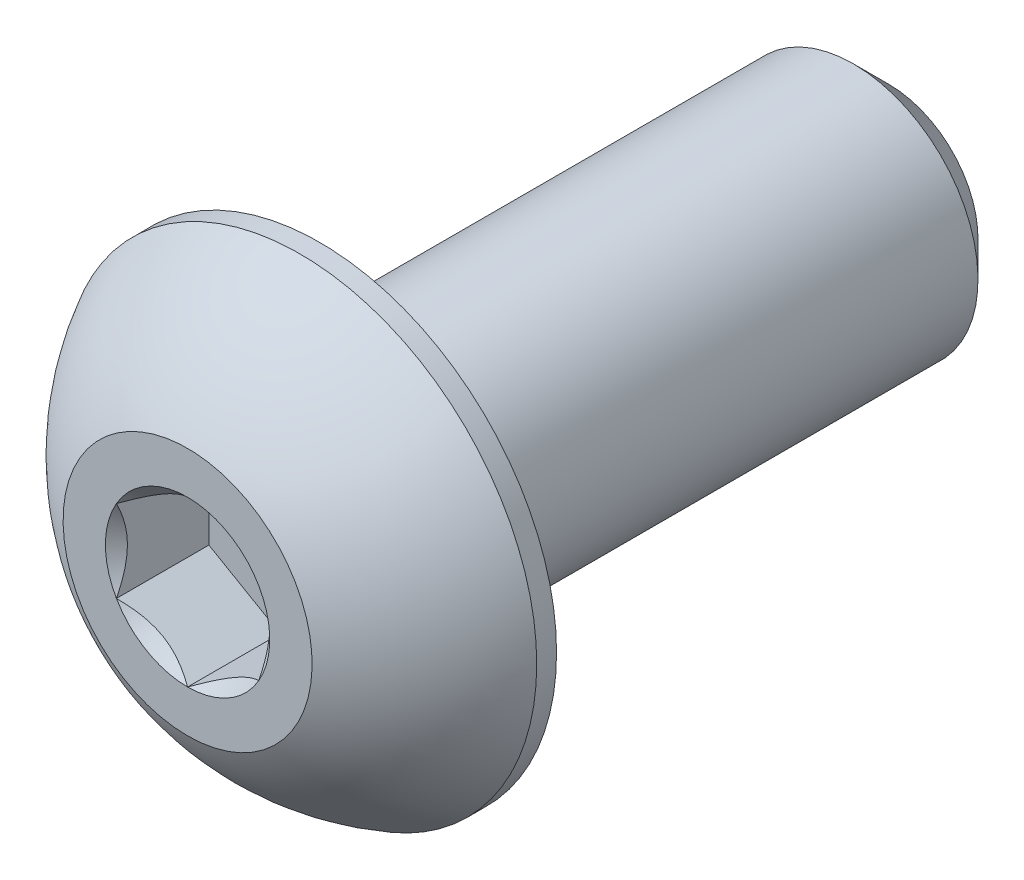
ISO-10303-21;
HEADER;
FILE_DESCRIPTION(('STEP AP214'),'2;1');
FILE_NAME('part.step','',(''),(''),'','','');
FILE_SCHEMA(('AUTOMOTIVE_DESIGN { 1 0 10303 214 1 1 1 1 }'));
ENDSEC;
DATA;
#1=APPLICATION_CONTEXT('core data for automotive mechanical design processes');
#2=APPLICATION_PROTOCOL_DEFINITION('international standard','automotive_design',2000,#1);
#3=PRODUCT_CONTEXT('',#1,'mechanical');
#4=PRODUCT('Part','Part','',(#3));
#5=PRODUCT_RELATED_PRODUCT_CATEGORY('part','',(#4));
#6=PRODUCT_DEFINITION_FORMATION('','',#4);
#7=PRODUCT_DEFINITION_CONTEXT('part definition',#1,'design');
#8=PRODUCT_DEFINITION('design','',#6,#7);
#9=PRODUCT_DEFINITION_SHAPE('','',#8);
#10=(LENGTH_UNIT() NAMED_UNIT(*) SI_UNIT(.MILLI.,.METRE.));
#11=(NAMED_UNIT(*) PLANE_ANGLE_UNIT() SI_UNIT($,.RADIAN.));
#12=(NAMED_UNIT(*) SI_UNIT($,.STERADIAN.) SOLID_ANGLE_UNIT());
#13=UNCERTAINTY_MEASURE_WITH_UNIT(LENGTH_MEASURE(1.E-05),#10,'distance_accuracy_value','');
#14=(GEOMETRIC_REPRESENTATION_CONTEXT(3) GLOBAL_UNCERTAINTY_ASSIGNED_CONTEXT((#13)) GLOBAL_UNIT_ASSIGNED_CONTEXT((#10,
#11,#12)) REPRESENTATION_CONTEXT('',''));
#15=CARTESIAN_POINT('',(0.,0.,0.));
#16=DIRECTION('',(0.,0.,1.));
#17=DIRECTION('',(1.,0.,0.));
#18=AXIS2_PLACEMENT_3D('',#15,#16,#17);
#19=CARTESIAN_POINT('',(0.,-2.08280000000001,-11.7348));
#20=DIRECTION('',(0.,0.,-1.));
#21=DIRECTION('',(0.,1.,0.));
#22=AXIS2_PLACEMENT_3D('',#19,#20,#21);
#23=PLANE('',#22);
#24=CARTESIAN_POINT('',(0.,0.,-11.7348));
#25=DIRECTION('',(0.,0.,-1.));
#26=DIRECTION('',(0.,1.,0.));
#27=AXIS2_PLACEMENT_3D('',#24,#25,#26);
#28=CIRCLE('',#27,1.48748750000001);
#29=CARTESIAN_POINT('',(0.,1.4874875,-11.7348));
#30=VERTEX_POINT('',#29);
#31=EDGE_CURVE('E176',#30,#30,#28,.T.);
#32=ORIENTED_EDGE('',*,*,#31,.T.);
#33=EDGE_LOOP('',(#32));
#34=FACE_BOUND('',#33,.T.);
#35=ADVANCED_FACE('F37',(#34),#23,.T.);
#36=CARTESIAN_POINT('',(0.,0.,-11.7348));
#37=DIRECTION('',(0.,0.,-1.));
#38=DIRECTION('',(0.,1.,0.));
#39=AXIS2_PLACEMENT_3D('',#36,#37,#38);
#40=CYLINDRICAL_SURFACE('',#39,2.08280000000001);
#41=CARTESIAN_POINT('',(0.,0.,-11.1394875));
#42=DIRECTION('',(0.,0.,-1.));
#43=DIRECTION('',(0.,1.,0.));
#44=AXIS2_PLACEMENT_3D('',#41,#42,#43);
#45=CIRCLE('',#44,2.08280000000001);
#46=CARTESIAN_POINT('',(0.,2.0828,-11.1394875));
#47=VERTEX_POINT('',#46);
#48=EDGE_CURVE('E50',#47,#47,#45,.F.);
#49=ORIENTED_EDGE('',*,*,#48,.T.);
#50=EDGE_LOOP('',(#49));
#51=FACE_BOUND('',#50,.T.);
#52=CARTESIAN_POINT('',(0.,0.,-2.2098));
#53=DIRECTION('',(0.,0.,1.));
#54=DIRECTION('',(1.,0.,0.));
#55=AXIS2_PLACEMENT_3D('',#52,#53,#54);
#56=CIRCLE('',#55,2.08280000000001);
#57=CARTESIAN_POINT('',(2.08280000000001,0.,-2.2098));
#58=VERTEX_POINT('',#57);
#59=EDGE_CURVE('E173',#58,#58,#56,.F.);
#60=ORIENTED_EDGE('',*,*,#59,.T.);
#61=EDGE_LOOP('',(#60));
#62=FACE_BOUND('',#61,.T.);
#63=ADVANCED_FACE('F181',(#51,#62),#40,.T.);
#64=CARTESIAN_POINT('',(0.,0.,-11.7348));
#65=DIRECTION('',(0.,0.,1.));
#66=DIRECTION('',(0.,-1.,0.));
#67=AXIS2_PLACEMENT_3D('',#64,#65,#66);
#68=CONICAL_SURFACE('',#67,1.48748750000001,0.785398163397446);
#69=ORIENTED_EDGE('',*,*,#48,.F.);
#70=EDGE_LOOP('',(#69));
#71=FACE_BOUND('',#70,.T.);
#72=ORIENTED_EDGE('',*,*,#31,.F.);
#73=EDGE_LOOP('',(#72));
#74=FACE_BOUND('',#73,.T.);
#75=ADVANCED_FACE('F39',(#71,#74),#68,.T.);
#76=CARTESIAN_POINT('',(0.,0.,-3.96380867816092));
#77=DIRECTION('',(0.,0.,1.));
#78=DIRECTION('',(0.,-1.,0.));
#79=AXIS2_PLACEMENT_3D('',#76,#77,#78);
#80=SPHERICAL_SURFACE('',#79,4.47770421947049);
#81=CARTESIAN_POINT('',(0.,0.,0.));
#82=DIRECTION('',(0.,0.,1.));
#83=DIRECTION('',(1.,0.,0.));
#84=AXIS2_PLACEMENT_3D('',#81,#82,#83);
#85=CIRCLE('',#84,2.0828);
#86=CARTESIAN_POINT('',(0.,-2.0828,0.));
#87=VERTEX_POINT('',#86);
#88=EDGE_CURVE('E170',#87,#87,#85,.T.);
#89=CARTESIAN_POINT('',(0.,0.,-1.87833));
#90=DIRECTION('',(0.,0.,1.));
#91=DIRECTION('',(1.,0.,0.));
#92=AXIS2_PLACEMENT_3D('',#89,#90,#91);
#93=CIRCLE('',#92,3.9624);
#94=CARTESIAN_POINT('',(0.,-3.9624,-1.87833));
#95=VERTEX_POINT('',#94);
#96=EDGE_CURVE('E164',#95,#95,#93,.T.);
#97=CARTESIAN_POINT('',(0.,-2.0828,0.));
#98=CARTESIAN_POINT('',(0.,-2.10767763915469,-0.013072022451911));
#99=CARTESIAN_POINT('',(0.,-2.13243218251379,-0.0263783080421205));
#100=CARTESIAN_POINT('',(0.,-2.18168637330346,-0.0534545587178038));
#101=CARTESIAN_POINT('',(0.,-2.20618602073402,-0.0672245238032775));
#102=CARTESIAN_POINT('',(0.,-2.25492171532922,-0.0952232866881565));
#103=CARTESIAN_POINT('',(0.,-2.27915776249387,-0.109452084487562));
#104=CARTESIAN_POINT('',(0.,-2.32735766987978,-0.138363459316014));
#105=CARTESIAN_POINT('',(0.,-2.35132153010105,-0.153046036345062));
#106=CARTESIAN_POINT('',(0.,-2.39896856692664,-0.18285976708332));
#107=CARTESIAN_POINT('',(0.,-2.42265174353097,-0.19799092079253));
#108=CARTESIAN_POINT('',(0.,-2.46972901769116,-0.228696440156809));
#109=CARTESIAN_POINT('',(0.,-2.49312311524702,-0.244270805811877));
#110=CARTESIAN_POINT('',(0.,-2.53961393789287,-0.275857228060144));
#111=CARTESIAN_POINT('',(0.,-2.56271066298286,-0.291869284653342));
#112=CARTESIAN_POINT('',(0.,-2.60859855282429,-0.324325412379582));
#113=CARTESIAN_POINT('',(0.,-2.63138971757574,-0.340769483512622));
#114=CARTESIAN_POINT('',(0.,-2.67665840715661,-0.37408381082988));
#115=CARTESIAN_POINT('',(0.,-2.69913593198603,-0.390954067014097));
#116=CARTESIAN_POINT('',(0.,-2.74376937333514,-0.425114783844112));
#117=CARTESIAN_POINT('',(0.,-2.76592528985483,-0.44240524448991));
#118=CARTESIAN_POINT('',(0.,-2.80990766020607,-0.477400240693377));
#119=CARTESIAN_POINT('',(0.,-2.83173411403762,-0.495104776251046));
#120=CARTESIAN_POINT('',(0.,-2.8750498214309,-0.530921645935844));
#121=CARTESIAN_POINT('',(0.,-2.89653907499262,-0.549033980062974));
#122=CARTESIAN_POINT('',(0.,-2.9391727638035,-0.585660025978065));
#123=CARTESIAN_POINT('',(0.,-2.96031719905264,-0.604173737766026));
#124=CARTESIAN_POINT('',(0.,-3.00225375543539,-0.641595975803774));
#125=CARTESIAN_POINT('',(0.,-3.02304587656899,-0.66050450205356));
#126=CARTESIAN_POINT('',(0.,-3.06427043381468,-0.698709665852366));
#127=CARTESIAN_POINT('',(0.,-3.08470286992677,-0.718006303401387));
#128=CARTESIAN_POINT('',(0.,-3.12520081373356,-0.756980849048762));
#129=CARTESIAN_POINT('',(0.,-3.14526632142825,-0.776658757147117));
#130=CARTESIAN_POINT('',(0.,-3.1850232950822,-0.816388867981037));
#131=CARTESIAN_POINT('',(0.,-3.20471476104147,-0.836441070716602));
#132=CARTESIAN_POINT('',(0.,-3.24371667050612,-0.876912662223586));
#133=CARTESIAN_POINT('',(0.,-3.2630271140115,-0.897332050995006));
#134=CARTESIAN_POINT('',(0.,-3.30126013292422,-0.938530775803146));
#135=CARTESIAN_POINT('',(0.,-3.32018270833155,-0.959310111839867));
#136=CARTESIAN_POINT('',(0.,-3.35763328290507,-1.00122136480504));
#137=CARTESIAN_POINT('',(0.,-3.37616128207125,-1.02235328173348));
#138=CARTESIAN_POINT('',(0.,-3.41281613589854,-1.06496220511693));
#139=CARTESIAN_POINT('',(0.,-3.43094299055964,-1.08643921157194));
#140=CARTESIAN_POINT('',(0.,-3.46678912932052,-1.12973070030741));
#141=CARTESIAN_POINT('',(0.,-3.48450841342031,-1.15154518258787));
#142=CARTESIAN_POINT('',(0.,-3.51953312948771,-1.19550388963656));
#143=CARTESIAN_POINT('',(0.,-3.53683856145534,-1.21764811440477));
#144=CARTESIAN_POINT('',(0.,-3.57102943840132,-1.26225845619532));
#145=CARTESIAN_POINT('',(0.,-3.58791488337967,-1.28472457321766));
#146=CARTESIAN_POINT('',(0.,-3.62125980037302,-1.32997073517287));
#147=CARTESIAN_POINT('',(0.,-3.637719272388,-1.35275078010575));
#148=CARTESIAN_POINT('',(0.,-3.67020640850626,-1.39861672224058));
#149=CARTESIAN_POINT('',(0.,-3.68623407260953,-1.42170261944253));
#150=CARTESIAN_POINT('',(0.,-3.71785191097313,-1.46817208208141));
#151=CARTESIAN_POINT('',(0.,-3.73344208523347,-1.49155564751835));
#152=CARTESIAN_POINT('',(0.,-3.76417941729919,-1.53861215694335));
#153=CARTESIAN_POINT('',(0.,-3.77932657510458,-1.56228510093141));
#154=CARTESIAN_POINT('',(0.,-3.80917250385283,-1.60991197565512));
#155=CARTESIAN_POINT('',(0.,-3.82387127479568,-1.63386590639077));
#156=CARTESIAN_POINT('',(0.,-3.85281522152763,-1.68204626145442));
#157=CARTESIAN_POINT('',(0.,-3.86706039731673,-1.70627268578243));
#158=CARTESIAN_POINT('',(0.,-3.89509209445425,-1.754989444771));
#159=CARTESIAN_POINT('',(0.,-3.90887861580268,-1.77947977943156));
#160=CARTESIAN_POINT('',(0.,-3.93598815139536,-1.8287156580258));
#161=CARTESIAN_POINT('',(0.,-3.94931116563961,-1.85346120195948));
#162=CARTESIAN_POINT('',(0.,-3.9624,-1.87833));
#163=B_SPLINE_CURVE_WITH_KNOTS('',3,(#97,#98,#99,#100,#101,#102,#103,#104,#105,#106,#107,#108,
#109,#110,#111,#112,#113,#114,#115,#116,#117,#118,#119,#120,#121,#122,#123,#124,#125,#126,#127,
#128,#129,#130,#131,#132,#133,#134,#135,#136,#137,#138,#139,#140,#141,#142,#143,#144,#145,#146,
#147,#148,#149,#150,#151,#152,#153,#154,#155,#156,#157,#158,#159,#160,#161,#162),.UNSPECIFIED.,
.F.,.F.,(4,2,2,2,2,2,2,2,2,2,2,2,2,2,2,2,2,2,2,2,2,2,2,2,2,2,2,2,2,2,2,2,4),(0.,
0.0843075442014962,0.168615088402992,0.252922632604488,0.337230176805985,0.421537721007481,
0.505845265208977,0.590152809410473,0.67446035361197,0.758767897813466,0.843075442014962,
0.927382986216458,1.01169053041795,1.09599807461945,1.18030561882095,1.26461316302244,
1.34892070722394,1.43322825142544,1.51753579562693,1.60184333982843,1.68615088402992,
1.77045842823142,1.85476597243292,1.93907351663441,2.02338106083591,2.10768860503741,
2.1919961492389,2.2763036934404,2.36061123764189,2.44491878184339,2.52922632604489,
2.61353387024638,2.69784141444788),.UNSPECIFIED.);
#164=EDGE_CURVE('BSEAM186',#87,#95,#163,.T.);
#165=ORIENTED_EDGE('',*,*,#88,.F.);
#166=ORIENTED_EDGE('',*,*,#96,.T.);
#167=ORIENTED_EDGE('',*,*,#164,.T.);
#168=ORIENTED_EDGE('',*,*,#164,.F.);
#169=EDGE_LOOP('',(#165,#167,#166,#168));
#170=FACE_BOUND('',#169,.T.);
#171=ADVANCED_FACE('F186',(#170),#80,.T.);
#172=CARTESIAN_POINT('',(0.,-2.0828,0.));
#173=DIRECTION('',(0.,0.,-1.));
#174=DIRECTION('',(-1.,0.,0.));
#175=AXIS2_PLACEMENT_3D('',#172,#173,#174);
#176=PLANE('',#175);
#177=CARTESIAN_POINT('',(0.,0.,0.));
#178=DIRECTION('',(0.,0.,1.));
#179=DIRECTION('',(1.,0.,0.));
#180=AXIS2_PLACEMENT_3D('',#177,#178,#179);
#181=CIRCLE('',#180,1.3748153285078);
#182=CARTESIAN_POINT('',(-1.190625,0.687407664253898,0.));
#183=VERTEX_POINT('',#182);
#184=CARTESIAN_POINT('',(-1.190625,-0.687407664253899,0.));
#185=VERTEX_POINT('',#184);
#186=EDGE_CURVE('E63',#183,#185,#181,.T.);
#187=ORIENTED_EDGE('',*,*,#186,.F.);
#188=CARTESIAN_POINT('',(0.,1.3748153285078,0.));
#189=VERTEX_POINT('',#188);
#190=EDGE_CURVE('E135',#189,#183,#181,.T.);
#191=ORIENTED_EDGE('',*,*,#190,.F.);
#192=CARTESIAN_POINT('',(1.190625,0.687407664253899,0.));
#193=VERTEX_POINT('',#192);
#194=EDGE_CURVE('E132',#193,#189,#181,.T.);
#195=ORIENTED_EDGE('',*,*,#194,.F.);
#196=CARTESIAN_POINT('',(1.190625,-0.687407664253899,0.));
#197=VERTEX_POINT('',#196);
#198=EDGE_CURVE('E103',#197,#193,#181,.T.);
#199=ORIENTED_EDGE('',*,*,#198,.F.);
#200=CARTESIAN_POINT('',(0.,-1.3748153285078,0.));
#201=VERTEX_POINT('',#200);
#202=EDGE_CURVE('E95',#201,#197,#181,.T.);
#203=ORIENTED_EDGE('',*,*,#202,.F.);
#204=EDGE_CURVE('E56',#185,#201,#181,.T.);
#205=ORIENTED_EDGE('',*,*,#204,.F.);
#206=EDGE_LOOP('',(#187,#191,#195,#199,#203,#205));
#207=FACE_BOUND('',#206,.T.);
#208=ORIENTED_EDGE('',*,*,#88,.T.);
#209=EDGE_LOOP('',(#208));
#210=FACE_BOUND('',#209,.T.);
#211=ADVANCED_FACE('F129',(#207,#210),#176,.F.);
#212=CARTESIAN_POINT('',(0.,-3.9624,-2.2098));
#213=DIRECTION('',(0.,0.,1.));
#214=DIRECTION('',(1.,0.,0.));
#215=AXIS2_PLACEMENT_3D('',#212,#213,#214);
#216=PLANE('',#215);
#217=ORIENTED_EDGE('',*,*,#59,.F.);
#218=EDGE_LOOP('',(#217));
#219=FACE_BOUND('',#218,.T.);
#220=CARTESIAN_POINT('',(0.,0.,-2.2098));
#221=DIRECTION('',(0.,0.,1.));
#222=DIRECTION('',(1.,0.,0.));
#223=AXIS2_PLACEMENT_3D('',#220,#221,#222);
#224=CIRCLE('',#223,3.9624);
#225=CARTESIAN_POINT('',(3.9624,0.,-2.2098));
#226=VERTEX_POINT('',#225);
#227=EDGE_CURVE('E167',#226,#226,#224,.T.);
#228=ORIENTED_EDGE('',*,*,#227,.F.);
#229=EDGE_LOOP('',(#228));
#230=FACE_BOUND('',#229,.T.);
#231=ADVANCED_FACE('F200',(#219,#230),#216,.F.);
#232=CARTESIAN_POINT('',(0.,0.,0.));
#233=DIRECTION('',(0.,0.,1.));
#234=DIRECTION('',(1.,0.,0.));
#235=AXIS2_PLACEMENT_3D('',#232,#233,#234);
#236=CYLINDRICAL_SURFACE('',#235,3.9624);
#237=ORIENTED_EDGE('',*,*,#96,.F.);
#238=EDGE_LOOP('',(#237));
#239=FACE_BOUND('',#238,.T.);
#240=ORIENTED_EDGE('',*,*,#227,.T.);
#241=EDGE_LOOP('',(#240));
#242=FACE_BOUND('',#241,.T.);
#243=ADVANCED_FACE('F203',(#239,#242),#236,.T.);
#244=CARTESIAN_POINT('',(0.,0.,0.));
#245=DIRECTION('',(0.,0.,1.));
#246=DIRECTION('',(1.,0.,0.));
#247=AXIS2_PLACEMENT_3D('',#244,#245,#246);
#248=CONICAL_SURFACE('',#247,1.3748153285078,0.78539816339745);
#249=ORIENTED_EDGE('',*,*,#198,.T.);
#250=CARTESIAN_POINT('',(1.190625,-1.37097145294693,0.44099044728994));
#251=CARTESIAN_POINT('',(1.190625,-1.3375892063789,0.415789988807826));
#252=CARTESIAN_POINT('',(1.190625,-1.30402095496658,0.39083662023745));
#253=CARTESIAN_POINT('',(1.190625,-1.23643692297761,0.341526087177203));
#254=CARTESIAN_POINT('',(1.190625,-1.20242103219112,0.317169073899369));
#255=CARTESIAN_POINT('',(1.190625,-1.09909081482554,0.244798208989213));
#256=CARTESIAN_POINT('',(1.190625,-1.02900143506767,0.197872622595561));
#257=CARTESIAN_POINT('',(1.190625,-0.882026737424228,0.105752103325632));
#258=CARTESIAN_POINT('',(1.190625,-0.804981866019979,0.0608088372420603));
#259=CARTESIAN_POINT('',(1.190625,-0.647043893307963,-0.0214019754931318));
#260=CARTESIAN_POINT('',(1.190625,-0.56616494370292,-0.0586953982678781));
#261=CARTESIAN_POINT('',(1.190625,-0.444764933868855,-0.104320444436902));
#262=CARTESIAN_POINT('',(1.190625,-0.406041211486712,-0.117415160978515));
#263=CARTESIAN_POINT('',(1.190625,-0.327658904711932,-0.140495724103359));
#264=CARTESIAN_POINT('',(1.190625,-0.288000256118251,-0.150481356514043));
#265=CARTESIAN_POINT('',(1.190625,-0.208647693212096,-0.166658770934747));
#266=CARTESIAN_POINT('',(1.190625,-0.168967240621961,-0.172915554151022));
#267=CARTESIAN_POINT('',(1.190625,-0.0891819742965329,-0.181513111581485));
#268=CARTESIAN_POINT('',(1.190625,-0.049077234701312,-0.183854558950103));
#269=CARTESIAN_POINT('',(1.190625,0.0297075773931767,-0.184447755932347));
#270=CARTESIAN_POINT('',(1.190625,0.0683866068288087,-0.182844646203951));
#271=CARTESIAN_POINT('',(1.190625,0.14541687663315,-0.175956972255488));
#272=CARTESIAN_POINT('',(1.190625,0.183768052740679,-0.170671702331516));
#273=CARTESIAN_POINT('',(1.190625,0.260508634904944,-0.156618587767133));
#274=CARTESIAN_POINT('',(1.190625,0.298887052039132,-0.14779163739419));
#275=CARTESIAN_POINT('',(1.190625,0.374805334250663,-0.127124290019378));
#276=CARTESIAN_POINT('',(1.190625,0.412345269207094,-0.115284145164062));
#277=CARTESIAN_POINT('',(1.190625,0.530535580908839,-0.073552666332807));
#278=CARTESIAN_POINT('',(1.190625,0.609503725744446,-0.0389086030856528));
#279=CARTESIAN_POINT('',(1.190625,0.763730269113465,0.0381182519748632));
#280=CARTESIAN_POINT('',(1.190625,0.838974064674605,0.0805288466686659));
#281=CARTESIAN_POINT('',(1.190625,0.982775796189618,0.168025645024959));
#282=CARTESIAN_POINT('',(1.190625,1.05148016607044,0.212874162055226));
#283=CARTESIAN_POINT('',(1.190625,1.15270222256253,0.282205329922606));
#284=CARTESIAN_POINT('',(1.190625,1.18600604145834,0.305560176337173));
#285=CARTESIAN_POINT('',(1.190625,1.25215860362231,0.35288756901931));
#286=CARTESIAN_POINT('',(1.190625,1.28500746868279,0.376859944858282));
#287=CARTESIAN_POINT('',(1.190625,1.31766689427973,0.401088366771255));
#288=B_SPLINE_CURVE_WITH_KNOTS('',3,(#250,#251,#252,#253,#254,#255,#256,#257,#258,#259,#260,
#261,#262,#263,#264,#265,#266,#267,#268,#269,#270,#271,#272,#273,#274,#275,#276,#277,#278,#279,
#280,#281,#282,#283,#284,#285,#286,#287),.UNSPECIFIED.,.F.,.F.,(4,2,2,2,2,2,2,2,2,2,2,2,2,2,2,2,
2,2,4),(0.,0.125475644763329,0.250982782413967,0.503912518769173,0.771279184643224,
1.03772598255657,1.16025581644629,1.28279408906665,1.40312855503246,1.5234423300503,
1.63939577664876,1.75537145240477,1.87336894094838,1.99135655861152,2.24929724983448,
2.50818004711563,2.75419821472196,2.87622362118596,2.99821570388961),.UNSPECIFIED.);
#289=EDGE_CURVE('E11',#197,#193,#288,.T.);
#290=ORIENTED_EDGE('',*,*,#289,.F.);
#291=EDGE_LOOP('',(#249,#290));
#292=FACE_BOUND('',#291,.T.);
#293=ADVANCED_FACE('F107',(#292),#248,.F.);
#294=ORIENTED_EDGE('',*,*,#194,.T.);
#295=CARTESIAN_POINT('',(1.190825,0.687292194200061,0.000115484600024123));
#296=CARTESIAN_POINT('',(1.14989058041014,0.710925692369385,-0.0235012357857365));
#297=CARTESIAN_POINT('',(1.10827161169803,0.734954415158721,-0.0457312182768792));
#298=CARTESIAN_POINT('',(1.02340555632637,0.78395185507261,-0.0864343373725628));
#299=CARTESIAN_POINT('',(0.980150392709039,0.808925235430915,-0.104884817352448));
#300=CARTESIAN_POINT('',(0.892928352542576,0.859282903800291,-0.136491161995679));
#301=CARTESIAN_POINT('',(0.848983705042075,0.884654357864149,-0.149726495756684));
#302=CARTESIAN_POINT('',(0.760126625836307,0.935956016463003,-0.170118548424605));
#303=CARTESIAN_POINT('',(0.715216911165245,0.96188465231757,-0.177290497104007));
#304=CARTESIAN_POINT('',(0.637820872343022,1.00656927616579,-0.183761461351144));
#305=CARTESIAN_POINT('',(0.605434587484354,1.025267506447,-0.18471967985321));
#306=CARTESIAN_POINT('',(0.54071892668223,1.06263111063189,-0.183107350927916));
#307=CARTESIAN_POINT('',(0.508389564872728,1.08129647637533,-0.180536024820421));
#308=CARTESIAN_POINT('',(0.444042843928515,1.11844707303394,-0.172013246006378));
#309=CARTESIAN_POINT('',(0.412025803663232,1.13693211984976,-0.166058645247436));
#310=CARTESIAN_POINT('',(0.348526236603543,1.17359361198509,-0.1510900359288));
#311=CARTESIAN_POINT('',(0.317043945355836,1.19176992131166,-0.142074714087946));
#312=CARTESIAN_POINT('',(0.236410161427873,1.23832385816825,-0.115317704161983));
#313=CARTESIAN_POINT('',(0.187767164732342,1.26640790540461,-0.0955631855639916));
#314=CARTESIAN_POINT('',(0.092385583647881,1.32147648691945,-0.0510632310423197));
#315=CARTESIAN_POINT('',(0.0456413824128443,1.34846426408555,-0.026334035283841));
#316=CARTESIAN_POINT('',(-0.000200000000000292,1.37493079856163,0.00011548460002435));
#317=B_SPLINE_CURVE_WITH_KNOTS('',3,(#295,#296,#297,#298,#299,#300,#301,#302,#303,#304,#305,
#306,#307,#308,#309,#310,#311,#312,#313,#314,#315,#316),.UNSPECIFIED.,.F.,.F.,(4,2,2,2,2,2,2,2,
2,2,4),(0.,0.15862567293412,0.318176079843271,0.475191357500655,0.631811068630748,
0.743878551794718,0.855970763007029,0.968167444423242,1.08041232768377,1.25873351645467,
1.43648174479847),.UNSPECIFIED.);
#318=EDGE_CURVE('E134',#193,#189,#317,.T.);
#319=ORIENTED_EDGE('',*,*,#318,.F.);
#320=EDGE_LOOP('',(#294,#319));
#321=FACE_BOUND('',#320,.T.);
#322=ADVANCED_FACE('F283',(#321),#248,.F.);
#323=ORIENTED_EDGE('',*,*,#190,.T.);
#324=CARTESIAN_POINT('',(0.000199999999999698,1.37493079856163,0.000115484600024211));
#325=CARTESIAN_POINT('',(-0.0407344195898566,1.35129730039231,-0.0235012357857363));
#326=CARTESIAN_POINT('',(-0.082353388301974,1.32726857760297,-0.045731218276879));
#327=CARTESIAN_POINT('',(-0.167219443673633,1.27827113768909,-0.0864343373725627));
#328=CARTESIAN_POINT('',(-0.210474607290961,1.25329775733078,-0.104884817352448));
#329=CARTESIAN_POINT('',(-0.297696647457424,1.2029400889614,-0.136491161995679));
#330=CARTESIAN_POINT('',(-0.341641294957925,1.17756863489755,-0.149726495756683));
#331=CARTESIAN_POINT('',(-0.430498374163694,1.12626697629869,-0.170118548424605));
#332=CARTESIAN_POINT('',(-0.475408088834755,1.10033834044413,-0.177290497104008));
#333=CARTESIAN_POINT('',(-0.552804127656978,1.0556537165959,-0.183761461351144));
#334=CARTESIAN_POINT('',(-0.585190412515647,1.0369554863147,-0.18471967985321));
#335=CARTESIAN_POINT('',(-0.64990607331777,0.99959188212981,-0.183107350927916));
#336=CARTESIAN_POINT('',(-0.682235435127273,0.980926516386364,-0.180536024820421));
#337=CARTESIAN_POINT('',(-0.746582156071485,0.943775919727754,-0.172013246006379));
#338=CARTESIAN_POINT('',(-0.778599196336768,0.925290872911937,-0.166058645247436));
#339=CARTESIAN_POINT('',(-0.842098763396457,0.888629380776601,-0.1510900359288));
#340=CARTESIAN_POINT('',(-0.873581054644164,0.870453071450031,-0.142074714087946));
#341=CARTESIAN_POINT('',(-0.954214838572127,0.823899134593444,-0.115317704161983));
#342=CARTESIAN_POINT('',(-1.00285783526766,0.795815087357089,-0.0955631855639917));
#343=CARTESIAN_POINT('',(-1.09823941635212,0.740746505842243,-0.0510632310423199));
#344=CARTESIAN_POINT('',(-1.14498361758716,0.713758728676141,-0.0263340352838413));
#345=CARTESIAN_POINT('',(-1.190825,0.68729219420006,0.000115484600024163));
#346=B_SPLINE_CURVE_WITH_KNOTS('',3,(#324,#325,#326,#327,#328,#329,#330,#331,#332,#333,#334,
#335,#336,#337,#338,#339,#340,#341,#342,#343,#344,#345),.UNSPECIFIED.,.F.,.F.,(4,2,2,2,2,2,2,2,
2,2,4),(0.,0.15862567293412,0.318176079843271,0.475191357500655,0.631811068630748,
0.743878551794718,0.855970763007029,0.968167444423242,1.08041232768377,1.25873351645467,
1.43648174479847),.UNSPECIFIED.);
#347=EDGE_CURVE('E139',#189,#183,#346,.T.);
#348=ORIENTED_EDGE('',*,*,#347,.F.);
#349=EDGE_LOOP('',(#323,#348));
#350=FACE_BOUND('',#349,.T.);
#351=ADVANCED_FACE('F142',(#350),#248,.F.);
#352=ORIENTED_EDGE('',*,*,#186,.T.);
#353=CARTESIAN_POINT('',(-1.190625,-1.37097145294694,0.440990447289942));
#354=CARTESIAN_POINT('',(-1.190625,-1.3375892063789,0.415789988807827));
#355=CARTESIAN_POINT('',(-1.190625,-1.30402095496658,0.390836620237451));
#356=CARTESIAN_POINT('',(-1.190625,-1.23643692297761,0.341526087177205));
#357=CARTESIAN_POINT('',(-1.190625,-1.20242103219112,0.31716907389937));
#358=CARTESIAN_POINT('',(-1.190625,-1.09909081482554,0.244798208989215));
#359=CARTESIAN_POINT('',(-1.190625,-1.02900143506767,0.197872622595562));
#360=CARTESIAN_POINT('',(-1.190625,-0.882026737424229,0.105752103325633));
#361=CARTESIAN_POINT('',(-1.190625,-0.804981866019981,0.0608088372420609));
#362=CARTESIAN_POINT('',(-1.190625,-0.647043893307964,-0.0214019754931314));
#363=CARTESIAN_POINT('',(-1.190625,-0.56616494370292,-0.0586953982678777));
#364=CARTESIAN_POINT('',(-1.190625,-0.444764933868855,-0.104320444436902));
#365=CARTESIAN_POINT('',(-1.190625,-0.406041211486713,-0.117415160978515));
#366=CARTESIAN_POINT('',(-1.190625,-0.327658904711932,-0.140495724103359));
#367=CARTESIAN_POINT('',(-1.190625,-0.288000256118252,-0.150481356514042));
#368=CARTESIAN_POINT('',(-1.190625,-0.208647693212097,-0.166658770934747));
#369=CARTESIAN_POINT('',(-1.190625,-0.168967240621961,-0.172915554151022));
#370=CARTESIAN_POINT('',(-1.190625,-0.0891819742965333,-0.181513111581485));
#371=CARTESIAN_POINT('',(-1.190625,-0.0490772347013125,-0.183854558950103));
#372=CARTESIAN_POINT('',(-1.190625,0.0297075773931762,-0.184447755932347));
#373=CARTESIAN_POINT('',(-1.190625,0.0683866068288084,-0.182844646203951));
#374=CARTESIAN_POINT('',(-1.190625,0.14541687663315,-0.175956972255488));
#375=CARTESIAN_POINT('',(-1.190625,0.183768052740678,-0.170671702331515));
#376=CARTESIAN_POINT('',(-1.190625,0.260508634904943,-0.156618587767132));
#377=CARTESIAN_POINT('',(-1.190625,0.298887052039132,-0.14779163739419));
#378=CARTESIAN_POINT('',(-1.190625,0.374805334250663,-0.127124290019378));
#379=CARTESIAN_POINT('',(-1.190625,0.412345269207093,-0.115284145164061));
#380=CARTESIAN_POINT('',(-1.190625,0.530535580908839,-0.0735526663328068));
#381=CARTESIAN_POINT('',(-1.190625,0.609503725744446,-0.0389086030856527));
#382=CARTESIAN_POINT('',(-1.190625,0.763730269113465,0.0381182519748633));
#383=CARTESIAN_POINT('',(-1.190625,0.838974064674605,0.080528846668666));
#384=CARTESIAN_POINT('',(-1.190625,0.982775796189618,0.16802564502496));
#385=CARTESIAN_POINT('',(-1.190625,1.05148016607044,0.212874162055227));
#386=CARTESIAN_POINT('',(-1.190625,1.15270222256253,0.282205329922607));
#387=CARTESIAN_POINT('',(-1.190625,1.18600604145834,0.305560176337174));
#388=CARTESIAN_POINT('',(-1.190625,1.25215860362231,0.35288756901931));
#389=CARTESIAN_POINT('',(-1.190625,1.28500746868279,0.376859944858282));
#390=CARTESIAN_POINT('',(-1.190625,1.31766689427973,0.401088366771255));
#391=B_SPLINE_CURVE_WITH_KNOTS('',3,(#353,#354,#355,#356,#357,#358,#359,#360,#361,#362,#363,
#364,#365,#366,#367,#368,#369,#370,#371,#372,#373,#374,#375,#376,#377,#378,#379,#380,#381,#382,
#383,#384,#385,#386,#387,#388,#389,#390),.UNSPECIFIED.,.F.,.F.,(4,2,2,2,2,2,2,2,2,2,2,2,2,2,2,2,
2,2,4),(0.,0.125475644763329,0.250982782413967,0.503912518769174,0.771279184643225,
1.03772598255657,1.16025581644629,1.28279408906665,1.40312855503247,1.5234423300503,
1.63939577664877,1.75537145240478,1.87336894094838,1.99135655861152,2.24929724983449,
2.50818004711563,2.75419821472196,2.87622362118597,2.99821570388961),.UNSPECIFIED.);
#392=EDGE_CURVE('E146',#183,#185,#391,.F.);
#393=ORIENTED_EDGE('',*,*,#392,.F.);
#394=EDGE_LOOP('',(#352,#393));
#395=FACE_BOUND('',#394,.T.);
#396=ADVANCED_FACE('F277',(#395),#248,.F.);
#397=ORIENTED_EDGE('',*,*,#204,.T.);
#398=CARTESIAN_POINT('',(-1.190825,-0.687292194200061,0.000115484600024123));
#399=CARTESIAN_POINT('',(-1.14989058041014,-0.710925692369386,-0.0235012357857365));
#400=CARTESIAN_POINT('',(-1.10827161169803,-0.734954415158721,-0.0457312182768791));
#401=CARTESIAN_POINT('',(-1.02340555632637,-0.78395185507261,-0.0864343373725627));
#402=CARTESIAN_POINT('',(-0.980150392709039,-0.808925235430916,-0.104884817352448));
#403=CARTESIAN_POINT('',(-0.892928352542576,-0.859282903800292,-0.136491161995679));
#404=CARTESIAN_POINT('',(-0.848983705042075,-0.884654357864149,-0.149726495756683));
#405=CARTESIAN_POINT('',(-0.760126625836306,-0.935956016463003,-0.170118548424605));
#406=CARTESIAN_POINT('',(-0.715216911165245,-0.96188465231757,-0.177290497104007));
#407=CARTESIAN_POINT('',(-0.637820872343022,-1.00656927616579,-0.183761461351143));
#408=CARTESIAN_POINT('',(-0.605434587484354,-1.025267506447,-0.18471967985321));
#409=CARTESIAN_POINT('',(-0.54071892668223,-1.06263111063189,-0.183107350927916));
#410=CARTESIAN_POINT('',(-0.508389564872728,-1.08129647637533,-0.180536024820421));
#411=CARTESIAN_POINT('',(-0.444042843928515,-1.11844707303394,-0.172013246006378));
#412=CARTESIAN_POINT('',(-0.412025803663232,-1.13693211984976,-0.166058645247436));
#413=CARTESIAN_POINT('',(-0.348526236603543,-1.17359361198509,-0.151090035928799));
#414=CARTESIAN_POINT('',(-0.317043945355836,-1.19176992131166,-0.142074714087945));
#415=CARTESIAN_POINT('',(-0.236410161427873,-1.23832385816825,-0.115317704161983));
#416=CARTESIAN_POINT('',(-0.187767164732342,-1.26640790540461,-0.0955631855639913));
#417=CARTESIAN_POINT('',(-0.0923855836478811,-1.32147648691945,-0.0510632310423195));
#418=CARTESIAN_POINT('',(-0.0456413824128445,-1.34846426408555,-0.0263340352838408));
#419=CARTESIAN_POINT('',(0.000200000000000169,-1.37493079856163,0.000115484600024484));
#420=B_SPLINE_CURVE_WITH_KNOTS('',3,(#398,#399,#400,#401,#402,#403,#404,#405,#406,#407,#408,
#409,#410,#411,#412,#413,#414,#415,#416,#417,#418,#419),.UNSPECIFIED.,.F.,.F.,(4,2,2,2,2,2,2,2,
2,2,4),(0.,0.15862567293412,0.318176079843271,0.475191357500655,0.631811068630748,
0.743878551794718,0.855970763007029,0.968167444423242,1.08041232768377,1.25873351645467,
1.43648174479847),.UNSPECIFIED.);
#421=EDGE_CURVE('E119',#185,#201,#420,.T.);
#422=ORIENTED_EDGE('',*,*,#421,.F.);
#423=EDGE_LOOP('',(#397,#422));
#424=FACE_BOUND('',#423,.T.);
#425=ADVANCED_FACE('F228',(#424),#248,.F.);
#426=ORIENTED_EDGE('',*,*,#202,.T.);
#427=CARTESIAN_POINT('',(-0.00019999999999994,-1.37493079856163,0.000115484600024428));
#428=CARTESIAN_POINT('',(0.0407344195898563,-1.35129730039231,-0.0235012357857361));
#429=CARTESIAN_POINT('',(0.0823533883019739,-1.32726857760297,-0.0457312182768789));
#430=CARTESIAN_POINT('',(0.167219443673633,-1.27827113768909,-0.0864343373725628));
#431=CARTESIAN_POINT('',(0.210474607290961,-1.25329775733078,-0.104884817352448));
#432=CARTESIAN_POINT('',(0.297696647457425,-1.2029400889614,-0.136491161995679));
#433=CARTESIAN_POINT('',(0.341641294957926,-1.17756863489755,-0.149726495756684));
#434=CARTESIAN_POINT('',(0.430498374163694,-1.12626697629869,-0.170118548424605));
#435=CARTESIAN_POINT('',(0.475408088834755,-1.10033834044412,-0.177290497104008));
#436=CARTESIAN_POINT('',(0.552804127656979,-1.0556537165959,-0.183761461351144));
#437=CARTESIAN_POINT('',(0.585190412515647,-1.0369554863147,-0.18471967985321));
#438=CARTESIAN_POINT('',(0.64990607331777,-0.99959188212981,-0.183107350927916));
#439=CARTESIAN_POINT('',(0.682235435127273,-0.980926516386364,-0.180536024820421));
#440=CARTESIAN_POINT('',(0.746582156071485,-0.943775919727753,-0.172013246006379));
#441=CARTESIAN_POINT('',(0.778599196336768,-0.925290872911937,-0.166058645247436));
#442=CARTESIAN_POINT('',(0.842098763396457,-0.888629380776601,-0.1510900359288));
#443=CARTESIAN_POINT('',(0.873581054644164,-0.870453071450031,-0.142074714087946));
#444=CARTESIAN_POINT('',(0.954214838572127,-0.823899134593444,-0.115317704161983));
#445=CARTESIAN_POINT('',(1.00285783526766,-0.795815087357089,-0.0955631855639917));
#446=CARTESIAN_POINT('',(1.09823941635212,-0.740746505842243,-0.05106323104232));
#447=CARTESIAN_POINT('',(1.14498361758716,-0.71375872867614,-0.0263340352838415));
#448=CARTESIAN_POINT('',(1.190825,-0.68729219420006,0.000115484600023912));
#449=B_SPLINE_CURVE_WITH_KNOTS('',3,(#427,#428,#429,#430,#431,#432,#433,#434,#435,#436,#437,
#438,#439,#440,#441,#442,#443,#444,#445,#446,#447,#448),.UNSPECIFIED.,.F.,.F.,(4,2,2,2,2,2,2,2,
2,2,4),(0.,0.158625672934121,0.318176079843272,0.475191357500656,0.631811068630749,
0.743878551794719,0.855970763007029,0.968167444423242,1.08041232768377,1.25873351645467,
1.43648174479847),.UNSPECIFIED.);
#450=EDGE_CURVE('E99',#201,#197,#449,.T.);
#451=ORIENTED_EDGE('',*,*,#450,.F.);
#452=EDGE_LOOP('',(#426,#451));
#453=FACE_BOUND('',#452,.T.);
#454=ADVANCED_FACE('F97',(#453),#248,.F.);
#455=CARTESIAN_POINT('',(1.190625,-0.687407664253898,-1.54686));
#456=DIRECTION('',(0.,0.,1.));
#457=DIRECTION('',(1.,0.,0.));
#458=AXIS2_PLACEMENT_3D('',#455,#456,#457);
#459=PLANE('',#458);
#460=DIRECTION('',(0.866025403784438,0.5,0.));
#461=VECTOR('',#460,1.);
#462=CARTESIAN_POINT('',(0.,-1.3748153285078,-1.54686));
#463=LINE('',#462,#461);
#464=CARTESIAN_POINT('',(0.,-1.3748153285078,-1.54686));
#465=VERTEX_POINT('',#464);
#466=CARTESIAN_POINT('',(1.190625,-0.687407664253898,-1.54686));
#467=VERTEX_POINT('',#466);
#468=EDGE_CURVE('E118',#465,#467,#463,.T.);
#469=ORIENTED_EDGE('',*,*,#468,.T.);
#470=DIRECTION('',(0.,1.,0.));
#471=VECTOR('',#470,1.);
#472=CARTESIAN_POINT('',(1.190625,-0.687407664253898,-1.54686));
#473=LINE('',#472,#471);
#474=CARTESIAN_POINT('',(1.190625,0.687407664253899,-1.54686));
#475=VERTEX_POINT('',#474);
#476=EDGE_CURVE('E123',#467,#475,#473,.T.);
#477=ORIENTED_EDGE('',*,*,#476,.T.);
#478=DIRECTION('',(-0.866025403784439,0.5,0.));
#479=VECTOR('',#478,1.);
#480=CARTESIAN_POINT('',(1.190625,0.687407664253899,-1.54686));
#481=LINE('',#480,#479);
#482=CARTESIAN_POINT('',(0.,1.3748153285078,-1.54686));
#483=VERTEX_POINT('',#482);
#484=EDGE_CURVE('E267',#475,#483,#481,.T.);
#485=ORIENTED_EDGE('',*,*,#484,.T.);
#486=DIRECTION('',(-0.866025403784438,-0.5,0.));
#487=VECTOR('',#486,1.);
#488=CARTESIAN_POINT('',(0.,1.3748153285078,-1.54686));
#489=LINE('',#488,#487);
#490=CARTESIAN_POINT('',(-1.190625,0.687407664253898,-1.54686));
#491=VERTEX_POINT('',#490);
#492=EDGE_CURVE('E155',#483,#491,#489,.T.);
#493=ORIENTED_EDGE('',*,*,#492,.T.);
#494=DIRECTION('',(0.,-1.,0.));
#495=VECTOR('',#494,1.);
#496=CARTESIAN_POINT('',(-1.190625,0.687407664253898,-1.54686));
#497=LINE('',#496,#495);
#498=CARTESIAN_POINT('',(-1.190625,-0.687407664253899,-1.54686));
#499=VERTEX_POINT('',#498);
#500=EDGE_CURVE('E271',#491,#499,#497,.T.);
#501=ORIENTED_EDGE('',*,*,#500,.T.);
#502=DIRECTION('',(0.866025403784439,-0.5,0.));
#503=VECTOR('',#502,1.);
#504=CARTESIAN_POINT('',(-1.190625,-0.687407664253899,-1.54686));
#505=LINE('',#504,#503);
#506=EDGE_CURVE('E126',#499,#465,#505,.T.);
#507=ORIENTED_EDGE('',*,*,#506,.T.);
#508=EDGE_LOOP('',(#469,#477,#485,#493,#501,#507));
#509=FACE_BOUND('',#508,.T.);
#510=ADVANCED_FACE('F227',(#509),#459,.T.);
#511=CARTESIAN_POINT('',(1.190625,-0.687407664253898,-1.54686));
#512=DIRECTION('',(1.,0.,0.));
#513=DIRECTION('',(0.,0.,-1.));
#514=AXIS2_PLACEMENT_3D('',#511,#512,#513);
#515=PLANE('',#514);
#516=DIRECTION('',(0.,0.,1.));
#517=VECTOR('',#516,1.);
#518=CARTESIAN_POINT('',(1.190625,-0.687407664253898,-1.54686));
#519=LINE('',#518,#517);
#520=EDGE_CURVE('E115',#467,#197,#519,.T.);
#521=ORIENTED_EDGE('',*,*,#520,.T.);
#522=ORIENTED_EDGE('',*,*,#289,.T.);
#523=DIRECTION('',(0.,0.,1.));
#524=VECTOR('',#523,1.);
#525=CARTESIAN_POINT('',(1.190625,0.687407664253899,-1.54686));
#526=LINE('',#525,#524);
#527=EDGE_CURVE('E125',#475,#193,#526,.T.);
#528=ORIENTED_EDGE('',*,*,#527,.F.);
#529=ORIENTED_EDGE('',*,*,#476,.F.);
#530=EDGE_LOOP('',(#521,#522,#528,#529));
#531=FACE_BOUND('',#530,.T.);
#532=ADVANCED_FACE('F121',(#531),#515,.F.);
#533=CARTESIAN_POINT('',(1.190625,0.687407664253899,-1.54686));
#534=DIRECTION('',(0.5,0.866025403784439,0.));
#535=DIRECTION('',(-0.866025403784439,0.5,0.));
#536=AXIS2_PLACEMENT_3D('',#533,#534,#535);
#537=PLANE('',#536);
#538=ORIENTED_EDGE('',*,*,#527,.T.);
#539=ORIENTED_EDGE('',*,*,#318,.T.);
#540=DIRECTION('',(0.,0.,1.));
#541=VECTOR('',#540,1.);
#542=CARTESIAN_POINT('',(0.,1.3748153285078,-1.54686));
#543=LINE('',#542,#541);
#544=EDGE_CURVE('E151',#483,#189,#543,.T.);
#545=ORIENTED_EDGE('',*,*,#544,.F.);
#546=ORIENTED_EDGE('',*,*,#484,.F.);
#547=EDGE_LOOP('',(#538,#539,#545,#546));
#548=FACE_BOUND('',#547,.T.);
#549=ADVANCED_FACE('F149',(#548),#537,.F.);
#550=CARTESIAN_POINT('',(0.,1.3748153285078,-1.54686));
#551=DIRECTION('',(-0.5,0.866025403784438,0.));
#552=DIRECTION('',(-0.866025403784439,-0.5,0.));
#553=AXIS2_PLACEMENT_3D('',#550,#551,#552);
#554=PLANE('',#553);
#555=ORIENTED_EDGE('',*,*,#544,.T.);
#556=ORIENTED_EDGE('',*,*,#347,.T.);
#557=DIRECTION('',(0.,0.,1.));
#558=VECTOR('',#557,1.);
#559=CARTESIAN_POINT('',(-1.190625,0.687407664253898,-1.54686));
#560=LINE('',#559,#558);
#561=EDGE_CURVE('E157',#491,#183,#560,.T.);
#562=ORIENTED_EDGE('',*,*,#561,.F.);
#563=ORIENTED_EDGE('',*,*,#492,.F.);
#564=EDGE_LOOP('',(#555,#556,#562,#563));
#565=FACE_BOUND('',#564,.T.);
#566=ADVANCED_FACE('F153',(#565),#554,.F.);
#567=CARTESIAN_POINT('',(-1.190625,0.687407664253898,-1.54686));
#568=DIRECTION('',(-1.,0.,0.));
#569=DIRECTION('',(0.,-1.,0.));
#570=AXIS2_PLACEMENT_3D('',#567,#568,#569);
#571=PLANE('',#570);
#572=ORIENTED_EDGE('',*,*,#561,.T.);
#573=ORIENTED_EDGE('',*,*,#392,.T.);
#574=DIRECTION('',(0.,0.,1.));
#575=VECTOR('',#574,1.);
#576=CARTESIAN_POINT('',(-1.190625,-0.687407664253899,-1.54686));
#577=LINE('',#576,#575);
#578=EDGE_CURVE('E159',#499,#185,#577,.T.);
#579=ORIENTED_EDGE('',*,*,#578,.F.);
#580=ORIENTED_EDGE('',*,*,#500,.F.);
#581=EDGE_LOOP('',(#572,#573,#579,#580));
#582=FACE_BOUND('',#581,.T.);
#583=ADVANCED_FACE('F246',(#582),#571,.F.);
#584=CARTESIAN_POINT('',(-1.190625,-0.687407664253899,-1.54686));
#585=DIRECTION('',(-0.5,-0.866025403784439,0.));
#586=DIRECTION('',(0.866025403784439,-0.5,0.));
#587=AXIS2_PLACEMENT_3D('',#584,#585,#586);
#588=PLANE('',#587);
#589=ORIENTED_EDGE('',*,*,#578,.T.);
#590=ORIENTED_EDGE('',*,*,#421,.T.);
#591=DIRECTION('',(0.,0.,1.));
#592=VECTOR('',#591,1.);
#593=CARTESIAN_POINT('',(0.,-1.3748153285078,-1.54686));
#594=LINE('',#593,#592);
#595=EDGE_CURVE('E117',#465,#201,#594,.T.);
#596=ORIENTED_EDGE('',*,*,#595,.F.);
#597=ORIENTED_EDGE('',*,*,#506,.F.);
#598=EDGE_LOOP('',(#589,#590,#596,#597));
#599=FACE_BOUND('',#598,.T.);
#600=ADVANCED_FACE('F210',(#599),#588,.F.);
#601=CARTESIAN_POINT('',(0.,-1.3748153285078,-1.54686));
#602=DIRECTION('',(0.5,-0.866025403784438,0.));
#603=DIRECTION('',(0.866025403784438,0.5,0.));
#604=AXIS2_PLACEMENT_3D('',#601,#602,#603);
#605=PLANE('',#604);
#606=ORIENTED_EDGE('',*,*,#595,.T.);
#607=ORIENTED_EDGE('',*,*,#450,.T.);
#608=ORIENTED_EDGE('',*,*,#520,.F.);
#609=ORIENTED_EDGE('',*,*,#468,.F.);
#610=EDGE_LOOP('',(#606,#607,#608,#609));
#611=FACE_BOUND('',#610,.T.);
#612=ADVANCED_FACE('F113',(#611),#605,.F.);
#613=CLOSED_SHELL('',(#35,#63,#75,#171,#211,#231,#243,#293,#322,#351,#396,#425,#454,#510,#532,
#549,#566,#583,#600,#612));
#614=MANIFOLD_SOLID_BREP('B2',#613);
#615=ADVANCED_BREP_SHAPE_REPRESENTATION('',(#18,#614),#14);
#616=SHAPE_DEFINITION_REPRESENTATION(#9,#615);
ENDSEC;
END-ISO-10303-21;
